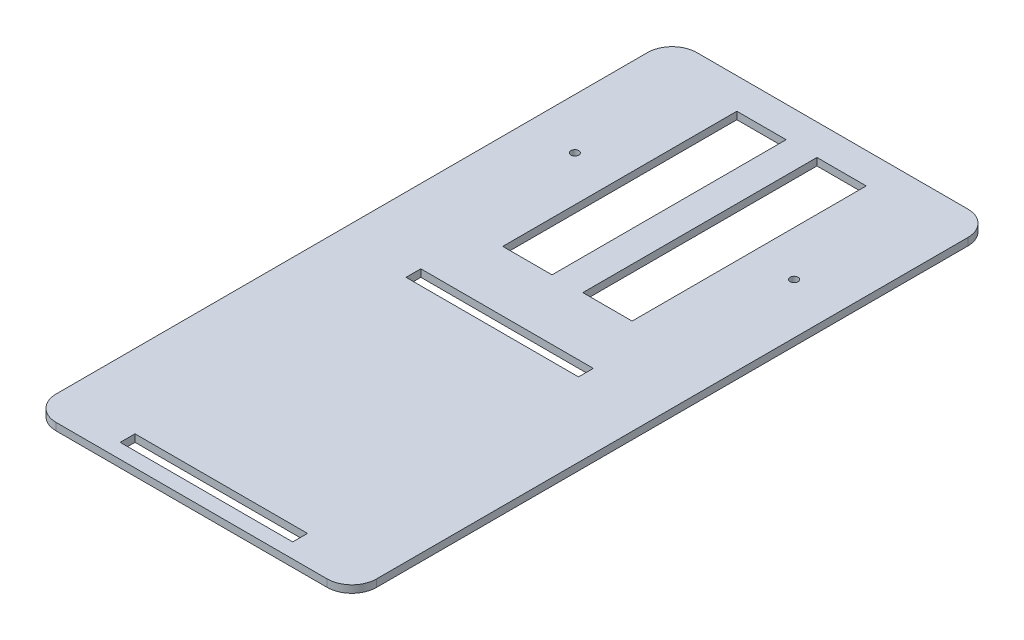
ISO-10303-21;
HEADER;
FILE_DESCRIPTION(('STEP AP214'),'2;1');
FILE_NAME('part.step','',(''),(''),'','','');
FILE_SCHEMA(('AUTOMOTIVE_DESIGN { 1 0 10303 214 1 1 1 1 }'));
ENDSEC;
DATA;
#1=APPLICATION_CONTEXT('core data for automotive mechanical design processes');
#2=APPLICATION_PROTOCOL_DEFINITION('international standard','automotive_design',2000,#1);
#3=PRODUCT_CONTEXT('',#1,'mechanical');
#4=PRODUCT('Part','Part','',(#3));
#5=PRODUCT_RELATED_PRODUCT_CATEGORY('part','',(#4));
#6=PRODUCT_DEFINITION_FORMATION('','',#4);
#7=PRODUCT_DEFINITION_CONTEXT('part definition',#1,'design');
#8=PRODUCT_DEFINITION('design','',#6,#7);
#9=PRODUCT_DEFINITION_SHAPE('','',#8);
#10=(LENGTH_UNIT() NAMED_UNIT(*) SI_UNIT(.MILLI.,.METRE.));
#11=(NAMED_UNIT(*) PLANE_ANGLE_UNIT() SI_UNIT($,.RADIAN.));
#12=(NAMED_UNIT(*) SI_UNIT($,.STERADIAN.) SOLID_ANGLE_UNIT());
#13=UNCERTAINTY_MEASURE_WITH_UNIT(LENGTH_MEASURE(1.E-05),#10,'distance_accuracy_value','');
#14=(GEOMETRIC_REPRESENTATION_CONTEXT(3) GLOBAL_UNCERTAINTY_ASSIGNED_CONTEXT((#13)) GLOBAL_UNIT_ASSIGNED_CONTEXT((#10,
#11,#12)) REPRESENTATION_CONTEXT('',''));
#15=CARTESIAN_POINT('',(0.,0.,0.));
#16=DIRECTION('',(0.,0.,1.));
#17=DIRECTION('',(1.,0.,0.));
#18=AXIS2_PLACEMENT_3D('',#15,#16,#17);
#19=CARTESIAN_POINT('',(0.,3.,0.));
#20=DIRECTION('',(0.,-1.,0.));
#21=DIRECTION('',(0.,0.,-1.));
#22=AXIS2_PLACEMENT_3D('',#19,#20,#21);
#23=PLANE('',#22);
#24=DIRECTION('',(1.,0.,0.));
#25=VECTOR('',#24,1.);
#26=CARTESIAN_POINT('',(0.,3.,72.));
#27=LINE('',#26,#25);
#28=CARTESIAN_POINT('',(-35.,3.,72.));
#29=VERTEX_POINT('',#28);
#30=CARTESIAN_POINT('',(35.,3.,72.));
#31=VERTEX_POINT('',#30);
#32=EDGE_CURVE('E266',#29,#31,#27,.T.);
#33=ORIENTED_EDGE('',*,*,#32,.T.);
#34=DIRECTION('',(0.,0.,1.));
#35=VECTOR('',#34,1.);
#36=CARTESIAN_POINT('',(35.,3.,0.));
#37=LINE('',#36,#35);
#38=CARTESIAN_POINT('',(35.,3.,78.));
#39=VERTEX_POINT('',#38);
#40=EDGE_CURVE('E203',#31,#39,#37,.T.);
#41=ORIENTED_EDGE('',*,*,#40,.T.);
#42=DIRECTION('',(-1.,0.,0.));
#43=VECTOR('',#42,1.);
#44=CARTESIAN_POINT('',(0.,3.,78.));
#45=LINE('',#44,#43);
#46=CARTESIAN_POINT('',(-35.,3.,78.));
#47=VERTEX_POINT('',#46);
#48=EDGE_CURVE('E271',#39,#47,#45,.T.);
#49=ORIENTED_EDGE('',*,*,#48,.T.);
#50=DIRECTION('',(0.,0.,-1.));
#51=VECTOR('',#50,1.);
#52=CARTESIAN_POINT('',(-35.,3.,0.));
#53=LINE('',#52,#51);
#54=EDGE_CURVE('E268',#47,#29,#53,.T.);
#55=ORIENTED_EDGE('',*,*,#54,.T.);
#56=EDGE_LOOP('',(#33,#41,#49,#55));
#57=FACE_BOUND('',#56,.T.);
#58=DIRECTION('',(1.,0.,0.));
#59=VECTOR('',#58,1.);
#60=CARTESIAN_POINT('',(0.,3.,188.));
#61=LINE('',#60,#59);
#62=CARTESIAN_POINT('',(-35.,3.,188.));
#63=VERTEX_POINT('',#62);
#64=CARTESIAN_POINT('',(35.,3.,188.));
#65=VERTEX_POINT('',#64);
#66=EDGE_CURVE('E231',#63,#65,#61,.T.);
#67=ORIENTED_EDGE('',*,*,#66,.T.);
#68=DIRECTION('',(0.,0.,1.));
#69=VECTOR('',#68,1.);
#70=CARTESIAN_POINT('',(35.,3.,0.));
#71=LINE('',#70,#69);
#72=CARTESIAN_POINT('',(35.,3.,194.));
#73=VERTEX_POINT('',#72);
#74=EDGE_CURVE('E263',#65,#73,#71,.T.);
#75=ORIENTED_EDGE('',*,*,#74,.T.);
#76=DIRECTION('',(-1.,0.,0.));
#77=VECTOR('',#76,1.);
#78=CARTESIAN_POINT('',(0.,3.,194.));
#79=LINE('',#78,#77);
#80=CARTESIAN_POINT('',(-35.,3.,194.));
#81=VERTEX_POINT('',#80);
#82=EDGE_CURVE('E260',#73,#81,#79,.T.);
#83=ORIENTED_EDGE('',*,*,#82,.T.);
#84=DIRECTION('',(0.,0.,-1.));
#85=VECTOR('',#84,1.);
#86=CARTESIAN_POINT('',(-35.,3.,0.));
#87=LINE('',#86,#85);
#88=EDGE_CURVE('E257',#81,#63,#87,.T.);
#89=ORIENTED_EDGE('',*,*,#88,.T.);
#90=EDGE_LOOP('',(#67,#75,#83,#89));
#91=FACE_BOUND('',#90,.T.);
#92=CARTESIAN_POINT('',(-44.5,3.,0.));
#93=DIRECTION('',(0.,-1.,0.));
#94=DIRECTION('',(0.,0.,-1.));
#95=AXIS2_PLACEMENT_3D('',#92,#93,#94);
#96=CIRCLE('',#95,1.6);
#97=CARTESIAN_POINT('',(-44.5,3.,-1.6));
#98=VERTEX_POINT('',#97);
#99=EDGE_CURVE('E284',#98,#98,#96,.F.);
#100=ORIENTED_EDGE('',*,*,#99,.F.);
#101=EDGE_LOOP('',(#100));
#102=FACE_BOUND('',#101,.T.);
#103=CARTESIAN_POINT('',(44.5,3.,0.));
#104=DIRECTION('',(0.,-1.,0.));
#105=DIRECTION('',(0.,0.,-1.));
#106=AXIS2_PLACEMENT_3D('',#103,#104,#105);
#107=CIRCLE('',#106,1.6);
#108=CARTESIAN_POINT('',(44.5,3.,-1.6));
#109=VERTEX_POINT('',#108);
#110=EDGE_CURVE('E290',#109,#109,#107,.T.);
#111=ORIENTED_EDGE('',*,*,#110,.T.);
#112=EDGE_LOOP('',(#111));
#113=FACE_BOUND('',#112,.T.);
#114=DIRECTION('',(-1.,0.,0.));
#115=VECTOR('',#114,1.);
#116=CARTESIAN_POINT('',(65.,3.,200.));
#117=LINE('',#116,#115);
#118=CARTESIAN_POINT('',(55.,3.,200.));
#119=VERTEX_POINT('',#118);
#120=CARTESIAN_POINT('',(-55.,3.,200.));
#121=VERTEX_POINT('',#120);
#122=EDGE_CURVE('E278',#119,#121,#117,.T.);
#123=ORIENTED_EDGE('',*,*,#122,.F.);
#124=CARTESIAN_POINT('',(55.,3.,190.));
#125=DIRECTION('',(0.,-1.,0.));
#126=DIRECTION('',(0.,0.,-1.));
#127=AXIS2_PLACEMENT_3D('',#124,#125,#126);
#128=CIRCLE('',#127,10.);
#129=CARTESIAN_POINT('',(65.,3.,190.));
#130=VERTEX_POINT('',#129);
#131=EDGE_CURVE('E386',#119,#130,#128,.F.);
#132=ORIENTED_EDGE('',*,*,#131,.T.);
#133=DIRECTION('',(0.,0.,-1.));
#134=VECTOR('',#133,1.);
#135=CARTESIAN_POINT('',(65.,3.,60.));
#136=LINE('',#135,#134);
#137=CARTESIAN_POINT('',(65.,3.,-50.));
#138=VERTEX_POINT('',#137);
#139=EDGE_CURVE('E358',#130,#138,#136,.T.);
#140=ORIENTED_EDGE('',*,*,#139,.T.);
#141=CARTESIAN_POINT('',(55.,3.,-50.));
#142=DIRECTION('',(0.,-1.,0.));
#143=DIRECTION('',(0.,0.,-1.));
#144=AXIS2_PLACEMENT_3D('',#141,#142,#143);
#145=CIRCLE('',#144,10.);
#146=CARTESIAN_POINT('',(55.,3.,-60.));
#147=VERTEX_POINT('',#146);
#148=EDGE_CURVE('E382',#138,#147,#145,.F.);
#149=ORIENTED_EDGE('',*,*,#148,.T.);
#150=DIRECTION('',(-1.,0.,0.));
#151=VECTOR('',#150,1.);
#152=CARTESIAN_POINT('',(-65.,3.,-60.));
#153=LINE('',#152,#151);
#154=CARTESIAN_POINT('',(-55.,3.,-60.));
#155=VERTEX_POINT('',#154);
#156=EDGE_CURVE('E361',#147,#155,#153,.T.);
#157=ORIENTED_EDGE('',*,*,#156,.T.);
#158=CARTESIAN_POINT('',(-55.,3.,-50.));
#159=DIRECTION('',(0.,-1.,0.));
#160=DIRECTION('',(0.,0.,-1.));
#161=AXIS2_PLACEMENT_3D('',#158,#159,#160);
#162=CIRCLE('',#161,10.);
#163=CARTESIAN_POINT('',(-65.,3.,-50.));
#164=VERTEX_POINT('',#163);
#165=EDGE_CURVE('E380',#155,#164,#162,.F.);
#166=ORIENTED_EDGE('',*,*,#165,.T.);
#167=DIRECTION('',(0.,0.,1.));
#168=VECTOR('',#167,1.);
#169=CARTESIAN_POINT('',(-65.,3.,60.));
#170=LINE('',#169,#168);
#171=CARTESIAN_POINT('',(-65.,3.,190.));
#172=VERTEX_POINT('',#171);
#173=EDGE_CURVE('E365',#164,#172,#170,.T.);
#174=ORIENTED_EDGE('',*,*,#173,.T.);
#175=CARTESIAN_POINT('',(-55.,3.,190.));
#176=DIRECTION('',(0.,-1.,0.));
#177=DIRECTION('',(0.,0.,-1.));
#178=AXIS2_PLACEMENT_3D('',#175,#176,#177);
#179=CIRCLE('',#178,10.);
#180=EDGE_CURVE('E384',#172,#121,#179,.F.);
#181=ORIENTED_EDGE('',*,*,#180,.T.);
#182=EDGE_LOOP('',(#123,#132,#140,#149,#157,#166,#174,#181));
#183=FACE_BOUND('',#182,.T.);
#184=DIRECTION('',(1.,0.,0.));
#185=VECTOR('',#184,1.);
#186=CARTESIAN_POINT('',(0.,3.,-47.5));
#187=LINE('',#186,#185);
#188=CARTESIAN_POINT('',(-26.25,3.,-47.5));
#189=VERTEX_POINT('',#188);
#190=CARTESIAN_POINT('',(-6.25,3.,-47.5));
#191=VERTEX_POINT('',#190);
#192=EDGE_CURVE('E338',#189,#191,#187,.T.);
#193=ORIENTED_EDGE('',*,*,#192,.T.);
#194=DIRECTION('',(0.,0.,1.));
#195=VECTOR('',#194,1.);
#196=CARTESIAN_POINT('',(-6.25,3.,0.));
#197=LINE('',#196,#195);
#198=CARTESIAN_POINT('',(-6.25,3.,47.5));
#199=VERTEX_POINT('',#198);
#200=EDGE_CURVE('E354',#191,#199,#197,.T.);
#201=ORIENTED_EDGE('',*,*,#200,.T.);
#202=DIRECTION('',(-1.,0.,0.));
#203=VECTOR('',#202,1.);
#204=CARTESIAN_POINT('',(0.,3.,47.5));
#205=LINE('',#204,#203);
#206=CARTESIAN_POINT('',(-26.25,3.,47.5));
#207=VERTEX_POINT('',#206);
#208=EDGE_CURVE('E351',#199,#207,#205,.T.);
#209=ORIENTED_EDGE('',*,*,#208,.T.);
#210=DIRECTION('',(0.,0.,-1.));
#211=VECTOR('',#210,1.);
#212=CARTESIAN_POINT('',(-26.25,3.,0.));
#213=LINE('',#212,#211);
#214=EDGE_CURVE('E348',#207,#189,#213,.T.);
#215=ORIENTED_EDGE('',*,*,#214,.T.);
#216=EDGE_LOOP('',(#193,#201,#209,#215));
#217=FACE_BOUND('',#216,.T.);
#218=DIRECTION('',(0.,0.,1.));
#219=VECTOR('',#218,1.);
#220=CARTESIAN_POINT('',(6.25,3.,0.));
#221=LINE('',#220,#219);
#222=CARTESIAN_POINT('',(6.25,3.,-47.5));
#223=VERTEX_POINT('',#222);
#224=CARTESIAN_POINT('',(6.25,3.,47.5));
#225=VERTEX_POINT('',#224);
#226=EDGE_CURVE('E319',#223,#225,#221,.T.);
#227=ORIENTED_EDGE('',*,*,#226,.F.);
#228=DIRECTION('',(-1.,0.,0.));
#229=VECTOR('',#228,1.);
#230=CARTESIAN_POINT('',(0.,3.,-47.5));
#231=LINE('',#230,#229);
#232=CARTESIAN_POINT('',(26.25,3.,-47.5));
#233=VERTEX_POINT('',#232);
#234=EDGE_CURVE('E317',#233,#223,#231,.T.);
#235=ORIENTED_EDGE('',*,*,#234,.F.);
#236=DIRECTION('',(0.,0.,-1.));
#237=VECTOR('',#236,1.);
#238=CARTESIAN_POINT('',(26.25,3.,0.));
#239=LINE('',#238,#237);
#240=CARTESIAN_POINT('',(26.25,3.,47.5));
#241=VERTEX_POINT('',#240);
#242=EDGE_CURVE('E315',#241,#233,#239,.T.);
#243=ORIENTED_EDGE('',*,*,#242,.F.);
#244=DIRECTION('',(1.,0.,0.));
#245=VECTOR('',#244,1.);
#246=CARTESIAN_POINT('',(0.,3.,47.5));
#247=LINE('',#246,#245);
#248=EDGE_CURVE('E306',#225,#241,#247,.T.);
#249=ORIENTED_EDGE('',*,*,#248,.F.);
#250=EDGE_LOOP('',(#227,#235,#243,#249));
#251=FACE_BOUND('',#250,.T.);
#252=ADVANCED_FACE('F33',(#57,#91,#102,#113,#183,#217,#251),#23,.F.);
#253=CARTESIAN_POINT('',(0.,0.,0.));
#254=DIRECTION('',(0.,-1.,0.));
#255=DIRECTION('',(0.,0.,-1.));
#256=AXIS2_PLACEMENT_3D('',#253,#254,#255);
#257=PLANE('',#256);
#258=DIRECTION('',(0.,0.,-1.));
#259=VECTOR('',#258,1.);
#260=CARTESIAN_POINT('',(35.,0.,78.));
#261=LINE('',#260,#259);
#262=CARTESIAN_POINT('',(35.,0.,78.));
#263=VERTEX_POINT('',#262);
#264=CARTESIAN_POINT('',(35.,0.,72.));
#265=VERTEX_POINT('',#264);
#266=EDGE_CURVE('E200',#263,#265,#261,.T.);
#267=ORIENTED_EDGE('',*,*,#266,.T.);
#268=DIRECTION('',(-1.,0.,0.));
#269=VECTOR('',#268,1.);
#270=CARTESIAN_POINT('',(-35.,0.,72.));
#271=LINE('',#270,#269);
#272=CARTESIAN_POINT('',(-35.,0.,72.));
#273=VERTEX_POINT('',#272);
#274=EDGE_CURVE('E211',#265,#273,#271,.T.);
#275=ORIENTED_EDGE('',*,*,#274,.T.);
#276=DIRECTION('',(0.,0.,1.));
#277=VECTOR('',#276,1.);
#278=CARTESIAN_POINT('',(-35.,0.,78.));
#279=LINE('',#278,#277);
#280=CARTESIAN_POINT('',(-35.,0.,78.));
#281=VERTEX_POINT('',#280);
#282=EDGE_CURVE('E216',#273,#281,#279,.T.);
#283=ORIENTED_EDGE('',*,*,#282,.T.);
#284=DIRECTION('',(1.,0.,0.));
#285=VECTOR('',#284,1.);
#286=CARTESIAN_POINT('',(-35.,0.,78.));
#287=LINE('',#286,#285);
#288=EDGE_CURVE('E207',#281,#263,#287,.T.);
#289=ORIENTED_EDGE('',*,*,#288,.T.);
#290=EDGE_LOOP('',(#267,#275,#283,#289));
#291=FACE_BOUND('',#290,.T.);
#292=DIRECTION('',(0.,0.,-1.));
#293=VECTOR('',#292,1.);
#294=CARTESIAN_POINT('',(35.,0.,194.));
#295=LINE('',#294,#293);
#296=CARTESIAN_POINT('',(35.,0.,194.));
#297=VERTEX_POINT('',#296);
#298=CARTESIAN_POINT('',(35.,0.,188.));
#299=VERTEX_POINT('',#298);
#300=EDGE_CURVE('E236',#297,#299,#295,.T.);
#301=ORIENTED_EDGE('',*,*,#300,.T.);
#302=DIRECTION('',(-1.,0.,0.));
#303=VECTOR('',#302,1.);
#304=CARTESIAN_POINT('',(-35.,0.,188.));
#305=LINE('',#304,#303);
#306=CARTESIAN_POINT('',(-35.,0.,188.));
#307=VERTEX_POINT('',#306);
#308=EDGE_CURVE('E239',#299,#307,#305,.T.);
#309=ORIENTED_EDGE('',*,*,#308,.T.);
#310=DIRECTION('',(0.,0.,1.));
#311=VECTOR('',#310,1.);
#312=CARTESIAN_POINT('',(-35.,0.,194.));
#313=LINE('',#312,#311);
#314=CARTESIAN_POINT('',(-35.,0.,194.));
#315=VERTEX_POINT('',#314);
#316=EDGE_CURVE('E242',#307,#315,#313,.T.);
#317=ORIENTED_EDGE('',*,*,#316,.T.);
#318=DIRECTION('',(1.,0.,0.));
#319=VECTOR('',#318,1.);
#320=CARTESIAN_POINT('',(-35.,0.,194.));
#321=LINE('',#320,#319);
#322=EDGE_CURVE('E245',#315,#297,#321,.T.);
#323=ORIENTED_EDGE('',*,*,#322,.T.);
#324=EDGE_LOOP('',(#301,#309,#317,#323));
#325=FACE_BOUND('',#324,.T.);
#326=CARTESIAN_POINT('',(-44.5,0.,0.));
#327=DIRECTION('',(0.,-1.,0.));
#328=DIRECTION('',(0.,0.,1.));
#329=AXIS2_PLACEMENT_3D('',#326,#327,#328);
#330=CIRCLE('',#329,1.6);
#331=CARTESIAN_POINT('',(-44.5,0.,1.6));
#332=VERTEX_POINT('',#331);
#333=EDGE_CURVE('E281',#332,#332,#330,.T.);
#334=ORIENTED_EDGE('',*,*,#333,.F.);
#335=EDGE_LOOP('',(#334));
#336=FACE_BOUND('',#335,.T.);
#337=CARTESIAN_POINT('',(44.5,0.,0.));
#338=DIRECTION('',(0.,1.,0.));
#339=DIRECTION('',(0.,0.,1.));
#340=AXIS2_PLACEMENT_3D('',#337,#338,#339);
#341=CIRCLE('',#340,1.6);
#342=CARTESIAN_POINT('',(44.5,0.,1.6));
#343=VERTEX_POINT('',#342);
#344=EDGE_CURVE('E287',#343,#343,#341,.T.);
#345=ORIENTED_EDGE('',*,*,#344,.T.);
#346=EDGE_LOOP('',(#345));
#347=FACE_BOUND('',#346,.T.);
#348=DIRECTION('',(0.,0.,-1.));
#349=VECTOR('',#348,1.);
#350=CARTESIAN_POINT('',(-6.25,0.,47.5));
#351=LINE('',#350,#349);
#352=CARTESIAN_POINT('',(-6.25,0.,47.5));
#353=VERTEX_POINT('',#352);
#354=CARTESIAN_POINT('',(-6.25,0.,-47.5));
#355=VERTEX_POINT('',#354);
#356=EDGE_CURVE('E322',#353,#355,#351,.T.);
#357=ORIENTED_EDGE('',*,*,#356,.T.);
#358=DIRECTION('',(-1.,0.,0.));
#359=VECTOR('',#358,1.);
#360=CARTESIAN_POINT('',(-26.25,0.,-47.5));
#361=LINE('',#360,#359);
#362=CARTESIAN_POINT('',(-26.25,0.,-47.5));
#363=VERTEX_POINT('',#362);
#364=EDGE_CURVE('E325',#355,#363,#361,.T.);
#365=ORIENTED_EDGE('',*,*,#364,.T.);
#366=DIRECTION('',(0.,0.,1.));
#367=VECTOR('',#366,1.);
#368=CARTESIAN_POINT('',(-26.25,0.,47.5));
#369=LINE('',#368,#367);
#370=CARTESIAN_POINT('',(-26.25,0.,47.5));
#371=VERTEX_POINT('',#370);
#372=EDGE_CURVE('E328',#363,#371,#369,.T.);
#373=ORIENTED_EDGE('',*,*,#372,.T.);
#374=DIRECTION('',(1.,0.,0.));
#375=VECTOR('',#374,1.);
#376=CARTESIAN_POINT('',(-26.25,0.,47.5));
#377=LINE('',#376,#375);
#378=EDGE_CURVE('E331',#371,#353,#377,.T.);
#379=ORIENTED_EDGE('',*,*,#378,.T.);
#380=EDGE_LOOP('',(#357,#365,#373,#379));
#381=FACE_BOUND('',#380,.T.);
#382=DIRECTION('',(0.,0.,-1.));
#383=VECTOR('',#382,1.);
#384=CARTESIAN_POINT('',(65.,0.,60.));
#385=LINE('',#384,#383);
#386=CARTESIAN_POINT('',(65.,0.,190.));
#387=VERTEX_POINT('',#386);
#388=CARTESIAN_POINT('',(65.,0.,-50.));
#389=VERTEX_POINT('',#388);
#390=EDGE_CURVE('E357',#387,#389,#385,.T.);
#391=ORIENTED_EDGE('',*,*,#390,.F.);
#392=CARTESIAN_POINT('',(55.,0.,190.));
#393=DIRECTION('',(0.,-1.,0.));
#394=DIRECTION('',(0.,0.,-1.));
#395=AXIS2_PLACEMENT_3D('',#392,#393,#394);
#396=CIRCLE('',#395,10.);
#397=CARTESIAN_POINT('',(55.,0.,200.));
#398=VERTEX_POINT('',#397);
#399=EDGE_CURVE('E396',#387,#398,#396,.T.);
#400=ORIENTED_EDGE('',*,*,#399,.T.);
#401=DIRECTION('',(1.,0.,0.));
#402=VECTOR('',#401,1.);
#403=CARTESIAN_POINT('',(-65.,0.,200.));
#404=LINE('',#403,#402);
#405=CARTESIAN_POINT('',(-55.,0.,200.));
#406=VERTEX_POINT('',#405);
#407=EDGE_CURVE('E275',#406,#398,#404,.T.);
#408=ORIENTED_EDGE('',*,*,#407,.F.);
#409=CARTESIAN_POINT('',(-55.,0.,190.));
#410=DIRECTION('',(0.,-1.,0.));
#411=DIRECTION('',(0.,0.,-1.));
#412=AXIS2_PLACEMENT_3D('',#409,#410,#411);
#413=CIRCLE('',#412,10.);
#414=CARTESIAN_POINT('',(-65.,0.,190.));
#415=VERTEX_POINT('',#414);
#416=EDGE_CURVE('E394',#406,#415,#413,.T.);
#417=ORIENTED_EDGE('',*,*,#416,.T.);
#418=DIRECTION('',(0.,0.,1.));
#419=VECTOR('',#418,1.);
#420=CARTESIAN_POINT('',(-65.,0.,60.));
#421=LINE('',#420,#419);
#422=CARTESIAN_POINT('',(-65.,0.,-50.));
#423=VERTEX_POINT('',#422);
#424=EDGE_CURVE('E362',#423,#415,#421,.T.);
#425=ORIENTED_EDGE('',*,*,#424,.F.);
#426=CARTESIAN_POINT('',(-55.,0.,-50.));
#427=DIRECTION('',(0.,-1.,0.));
#428=DIRECTION('',(0.,0.,-1.));
#429=AXIS2_PLACEMENT_3D('',#426,#427,#428);
#430=CIRCLE('',#429,10.);
#431=CARTESIAN_POINT('',(-55.,0.,-60.));
#432=VERTEX_POINT('',#431);
#433=EDGE_CURVE('E48',#423,#432,#430,.T.);
#434=ORIENTED_EDGE('',*,*,#433,.T.);
#435=DIRECTION('',(-1.,0.,0.));
#436=VECTOR('',#435,1.);
#437=CARTESIAN_POINT('',(-65.,0.,-60.));
#438=LINE('',#437,#436);
#439=CARTESIAN_POINT('',(55.,0.,-60.));
#440=VERTEX_POINT('',#439);
#441=EDGE_CURVE('E371',#440,#432,#438,.T.);
#442=ORIENTED_EDGE('',*,*,#441,.F.);
#443=CARTESIAN_POINT('',(55.,0.,-50.));
#444=DIRECTION('',(0.,-1.,0.));
#445=DIRECTION('',(0.,0.,-1.));
#446=AXIS2_PLACEMENT_3D('',#443,#444,#445);
#447=CIRCLE('',#446,10.);
#448=EDGE_CURVE('E56',#440,#389,#447,.T.);
#449=ORIENTED_EDGE('',*,*,#448,.T.);
#450=EDGE_LOOP('',(#391,#400,#408,#417,#425,#434,#442,#449));
#451=FACE_BOUND('',#450,.T.);
#452=DIRECTION('',(1.,0.,0.));
#453=VECTOR('',#452,1.);
#454=CARTESIAN_POINT('',(26.25,0.,-47.5));
#455=LINE('',#454,#453);
#456=CARTESIAN_POINT('',(6.25,0.,-47.5));
#457=VERTEX_POINT('',#456);
#458=CARTESIAN_POINT('',(26.25,0.,-47.5));
#459=VERTEX_POINT('',#458);
#460=EDGE_CURVE('E300',#457,#459,#455,.T.);
#461=ORIENTED_EDGE('',*,*,#460,.F.);
#462=DIRECTION('',(0.,0.,-1.));
#463=VECTOR('',#462,1.);
#464=CARTESIAN_POINT('',(6.25,0.,47.5));
#465=LINE('',#464,#463);
#466=CARTESIAN_POINT('',(6.25,0.,47.5));
#467=VERTEX_POINT('',#466);
#468=EDGE_CURVE('E293',#467,#457,#465,.T.);
#469=ORIENTED_EDGE('',*,*,#468,.F.);
#470=DIRECTION('',(-1.,0.,0.));
#471=VECTOR('',#470,1.);
#472=CARTESIAN_POINT('',(26.25,0.,47.5));
#473=LINE('',#472,#471);
#474=CARTESIAN_POINT('',(26.25,0.,47.5));
#475=VERTEX_POINT('',#474);
#476=EDGE_CURVE('E295',#475,#467,#473,.T.);
#477=ORIENTED_EDGE('',*,*,#476,.F.);
#478=DIRECTION('',(0.,0.,1.));
#479=VECTOR('',#478,1.);
#480=CARTESIAN_POINT('',(26.25,0.,47.5));
#481=LINE('',#480,#479);
#482=EDGE_CURVE('E297',#459,#475,#481,.T.);
#483=ORIENTED_EDGE('',*,*,#482,.F.);
#484=EDGE_LOOP('',(#461,#469,#477,#483));
#485=FACE_BOUND('',#484,.T.);
#486=ADVANCED_FACE('F218',(#291,#325,#336,#347,#381,#451,#485),#257,.T.);
#487=CARTESIAN_POINT('',(65.,3.,60.));
#488=DIRECTION('',(-1.,0.,0.));
#489=DIRECTION('',(0.,0.,1.));
#490=AXIS2_PLACEMENT_3D('',#487,#488,#489);
#491=PLANE('',#490);
#492=ORIENTED_EDGE('',*,*,#139,.F.);
#493=DIRECTION('',(0.,1.,0.));
#494=VECTOR('',#493,1.);
#495=CARTESIAN_POINT('',(65.,0.,190.));
#496=LINE('',#495,#494);
#497=EDGE_CURVE('E390',#130,#387,#496,.F.);
#498=ORIENTED_EDGE('',*,*,#497,.T.);
#499=ORIENTED_EDGE('',*,*,#390,.T.);
#500=DIRECTION('',(0.,-1.,0.));
#501=VECTOR('',#500,1.);
#502=CARTESIAN_POINT('',(65.,3.,-50.));
#503=LINE('',#502,#501);
#504=EDGE_CURVE('E388',#389,#138,#503,.F.);
#505=ORIENTED_EDGE('',*,*,#504,.T.);
#506=EDGE_LOOP('',(#492,#498,#499,#505));
#507=FACE_BOUND('',#506,.T.);
#508=ADVANCED_FACE('F431',(#507),#491,.F.);
#509=CARTESIAN_POINT('',(-65.,3.,-60.));
#510=DIRECTION('',(0.,0.,1.));
#511=DIRECTION('',(1.,0.,0.));
#512=AXIS2_PLACEMENT_3D('',#509,#510,#511);
#513=PLANE('',#512);
#514=ORIENTED_EDGE('',*,*,#156,.F.);
#515=DIRECTION('',(0.,-1.,0.));
#516=VECTOR('',#515,1.);
#517=CARTESIAN_POINT('',(55.,3.,-60.));
#518=LINE('',#517,#516);
#519=EDGE_CURVE('E11',#147,#440,#518,.T.);
#520=ORIENTED_EDGE('',*,*,#519,.T.);
#521=ORIENTED_EDGE('',*,*,#441,.T.);
#522=DIRECTION('',(0.,-1.,0.));
#523=VECTOR('',#522,1.);
#524=CARTESIAN_POINT('',(-55.,3.,-60.));
#525=LINE('',#524,#523);
#526=EDGE_CURVE('E41',#432,#155,#525,.F.);
#527=ORIENTED_EDGE('',*,*,#526,.T.);
#528=EDGE_LOOP('',(#514,#520,#521,#527));
#529=FACE_BOUND('',#528,.T.);
#530=ADVANCED_FACE('F405',(#529),#513,.F.);
#531=CARTESIAN_POINT('',(-65.,3.,60.));
#532=DIRECTION('',(1.,0.,0.));
#533=DIRECTION('',(0.,0.,-1.));
#534=AXIS2_PLACEMENT_3D('',#531,#532,#533);
#535=PLANE('',#534);
#536=ORIENTED_EDGE('',*,*,#424,.T.);
#537=DIRECTION('',(0.,-1.,0.));
#538=VECTOR('',#537,1.);
#539=CARTESIAN_POINT('',(-65.,3.,190.));
#540=LINE('',#539,#538);
#541=EDGE_CURVE('E401',#415,#172,#540,.F.);
#542=ORIENTED_EDGE('',*,*,#541,.T.);
#543=ORIENTED_EDGE('',*,*,#173,.F.);
#544=DIRECTION('',(0.,-1.,0.));
#545=VECTOR('',#544,1.);
#546=CARTESIAN_POINT('',(-65.,3.,-50.));
#547=LINE('',#546,#545);
#548=EDGE_CURVE('E398',#164,#423,#547,.T.);
#549=ORIENTED_EDGE('',*,*,#548,.T.);
#550=EDGE_LOOP('',(#536,#542,#543,#549));
#551=FACE_BOUND('',#550,.T.);
#552=ADVANCED_FACE('F415',(#551),#535,.F.);
#553=CARTESIAN_POINT('',(-6.25,0.,47.5));
#554=DIRECTION('',(1.,0.,0.));
#555=DIRECTION('',(0.,0.,-1.));
#556=AXIS2_PLACEMENT_3D('',#553,#554,#555);
#557=PLANE('',#556);
#558=DIRECTION('',(0.,1.,0.));
#559=VECTOR('',#558,1.);
#560=CARTESIAN_POINT('',(-6.25,0.,-47.5));
#561=LINE('',#560,#559);
#562=EDGE_CURVE('E334',#355,#191,#561,.T.);
#563=ORIENTED_EDGE('',*,*,#562,.F.);
#564=ORIENTED_EDGE('',*,*,#356,.F.);
#565=DIRECTION('',(0.,1.,0.));
#566=VECTOR('',#565,1.);
#567=CARTESIAN_POINT('',(-6.25,0.,47.5));
#568=LINE('',#567,#566);
#569=EDGE_CURVE('E335',#353,#199,#568,.T.);
#570=ORIENTED_EDGE('',*,*,#569,.T.);
#571=ORIENTED_EDGE('',*,*,#200,.F.);
#572=EDGE_LOOP('',(#563,#564,#570,#571));
#573=FACE_BOUND('',#572,.T.);
#574=ADVANCED_FACE('F451',(#573),#557,.F.);
#575=CARTESIAN_POINT('',(-26.25,0.,47.5));
#576=DIRECTION('',(0.,0.,1.));
#577=DIRECTION('',(1.,0.,0.));
#578=AXIS2_PLACEMENT_3D('',#575,#576,#577);
#579=PLANE('',#578);
#580=ORIENTED_EDGE('',*,*,#569,.F.);
#581=ORIENTED_EDGE('',*,*,#378,.F.);
#582=DIRECTION('',(0.,1.,0.));
#583=VECTOR('',#582,1.);
#584=CARTESIAN_POINT('',(-26.25,0.,47.5));
#585=LINE('',#584,#583);
#586=EDGE_CURVE('E339',#371,#207,#585,.T.);
#587=ORIENTED_EDGE('',*,*,#586,.T.);
#588=ORIENTED_EDGE('',*,*,#208,.F.);
#589=EDGE_LOOP('',(#580,#581,#587,#588));
#590=FACE_BOUND('',#589,.T.);
#591=ADVANCED_FACE('F518',(#590),#579,.F.);
#592=CARTESIAN_POINT('',(-26.25,0.,47.5));
#593=DIRECTION('',(-1.,0.,0.));
#594=DIRECTION('',(0.,0.,1.));
#595=AXIS2_PLACEMENT_3D('',#592,#593,#594);
#596=PLANE('',#595);
#597=ORIENTED_EDGE('',*,*,#586,.F.);
#598=ORIENTED_EDGE('',*,*,#372,.F.);
#599=DIRECTION('',(0.,1.,0.));
#600=VECTOR('',#599,1.);
#601=CARTESIAN_POINT('',(-26.25,0.,-47.5));
#602=LINE('',#601,#600);
#603=EDGE_CURVE('E342',#363,#189,#602,.T.);
#604=ORIENTED_EDGE('',*,*,#603,.T.);
#605=ORIENTED_EDGE('',*,*,#214,.F.);
#606=EDGE_LOOP('',(#597,#598,#604,#605));
#607=FACE_BOUND('',#606,.T.);
#608=ADVANCED_FACE('F521',(#607),#596,.F.);
#609=CARTESIAN_POINT('',(-26.25,0.,-47.5));
#610=DIRECTION('',(0.,0.,-1.));
#611=DIRECTION('',(-1.,0.,0.));
#612=AXIS2_PLACEMENT_3D('',#609,#610,#611);
#613=PLANE('',#612);
#614=ORIENTED_EDGE('',*,*,#603,.F.);
#615=ORIENTED_EDGE('',*,*,#364,.F.);
#616=ORIENTED_EDGE('',*,*,#562,.T.);
#617=ORIENTED_EDGE('',*,*,#192,.F.);
#618=EDGE_LOOP('',(#614,#615,#616,#617));
#619=FACE_BOUND('',#618,.T.);
#620=ADVANCED_FACE('F516',(#619),#613,.F.);
#621=CARTESIAN_POINT('',(6.25,0.,47.5));
#622=DIRECTION('',(1.,0.,0.));
#623=DIRECTION('',(0.,0.,-1.));
#624=AXIS2_PLACEMENT_3D('',#621,#622,#623);
#625=PLANE('',#624);
#626=ORIENTED_EDGE('',*,*,#226,.T.);
#627=DIRECTION('',(0.,1.,0.));
#628=VECTOR('',#627,1.);
#629=CARTESIAN_POINT('',(6.25,0.,47.5));
#630=LINE('',#629,#628);
#631=EDGE_CURVE('E302',#467,#225,#630,.T.);
#632=ORIENTED_EDGE('',*,*,#631,.F.);
#633=ORIENTED_EDGE('',*,*,#468,.T.);
#634=DIRECTION('',(0.,1.,0.));
#635=VECTOR('',#634,1.);
#636=CARTESIAN_POINT('',(6.25,0.,-47.5));
#637=LINE('',#636,#635);
#638=EDGE_CURVE('E303',#457,#223,#637,.T.);
#639=ORIENTED_EDGE('',*,*,#638,.T.);
#640=EDGE_LOOP('',(#626,#632,#633,#639));
#641=FACE_BOUND('',#640,.T.);
#642=ADVANCED_FACE('F506',(#641),#625,.T.);
#643=CARTESIAN_POINT('',(26.25,0.,-47.5));
#644=DIRECTION('',(0.,0.,1.));
#645=DIRECTION('',(1.,0.,0.));
#646=AXIS2_PLACEMENT_3D('',#643,#644,#645);
#647=PLANE('',#646);
#648=ORIENTED_EDGE('',*,*,#234,.T.);
#649=ORIENTED_EDGE('',*,*,#638,.F.);
#650=ORIENTED_EDGE('',*,*,#460,.T.);
#651=DIRECTION('',(0.,1.,0.));
#652=VECTOR('',#651,1.);
#653=CARTESIAN_POINT('',(26.25,0.,-47.5));
#654=LINE('',#653,#652);
#655=EDGE_CURVE('E307',#459,#233,#654,.T.);
#656=ORIENTED_EDGE('',*,*,#655,.T.);
#657=EDGE_LOOP('',(#648,#649,#650,#656));
#658=FACE_BOUND('',#657,.T.);
#659=ADVANCED_FACE('F502',(#658),#647,.T.);
#660=CARTESIAN_POINT('',(26.25,0.,47.5));
#661=DIRECTION('',(-1.,0.,0.));
#662=DIRECTION('',(0.,0.,1.));
#663=AXIS2_PLACEMENT_3D('',#660,#661,#662);
#664=PLANE('',#663);
#665=ORIENTED_EDGE('',*,*,#242,.T.);
#666=ORIENTED_EDGE('',*,*,#655,.F.);
#667=ORIENTED_EDGE('',*,*,#482,.T.);
#668=DIRECTION('',(0.,1.,0.));
#669=VECTOR('',#668,1.);
#670=CARTESIAN_POINT('',(26.25,0.,47.5));
#671=LINE('',#670,#669);
#672=EDGE_CURVE('E310',#475,#241,#671,.T.);
#673=ORIENTED_EDGE('',*,*,#672,.T.);
#674=EDGE_LOOP('',(#665,#666,#667,#673));
#675=FACE_BOUND('',#674,.T.);
#676=ADVANCED_FACE('F505',(#675),#664,.T.);
#677=CARTESIAN_POINT('',(26.25,0.,47.5));
#678=DIRECTION('',(0.,0.,-1.));
#679=DIRECTION('',(-1.,0.,0.));
#680=AXIS2_PLACEMENT_3D('',#677,#678,#679);
#681=PLANE('',#680);
#682=ORIENTED_EDGE('',*,*,#248,.T.);
#683=ORIENTED_EDGE('',*,*,#672,.F.);
#684=ORIENTED_EDGE('',*,*,#476,.T.);
#685=ORIENTED_EDGE('',*,*,#631,.T.);
#686=EDGE_LOOP('',(#682,#683,#684,#685));
#687=FACE_BOUND('',#686,.T.);
#688=ADVANCED_FACE('F500',(#687),#681,.T.);
#689=CARTESIAN_POINT('',(44.5,0.,0.));
#690=DIRECTION('',(0.,1.,0.));
#691=DIRECTION('',(0.,0.,1.));
#692=AXIS2_PLACEMENT_3D('',#689,#690,#691);
#693=CYLINDRICAL_SURFACE('',#692,1.6);
#694=ORIENTED_EDGE('',*,*,#344,.F.);
#695=EDGE_LOOP('',(#694));
#696=FACE_BOUND('',#695,.T.);
#697=ORIENTED_EDGE('',*,*,#110,.F.);
#698=EDGE_LOOP('',(#697));
#699=FACE_BOUND('',#698,.T.);
#700=ADVANCED_FACE('F496',(#696,#699),#693,.F.);
#701=CARTESIAN_POINT('',(-44.5,0.,0.));
#702=DIRECTION('',(0.,1.,0.));
#703=DIRECTION('',(0.,0.,1.));
#704=AXIS2_PLACEMENT_3D('',#701,#702,#703);
#705=CYLINDRICAL_SURFACE('',#704,1.6);
#706=ORIENTED_EDGE('',*,*,#333,.T.);
#707=EDGE_LOOP('',(#706));
#708=FACE_BOUND('',#707,.T.);
#709=ORIENTED_EDGE('',*,*,#99,.T.);
#710=EDGE_LOOP('',(#709));
#711=FACE_BOUND('',#710,.T.);
#712=ADVANCED_FACE('F494',(#708,#711),#705,.F.);
#713=CARTESIAN_POINT('',(0.,0.,200.));
#714=DIRECTION('',(0.,0.,1.));
#715=DIRECTION('',(1.,0.,0.));
#716=AXIS2_PLACEMENT_3D('',#713,#714,#715);
#717=PLANE('',#716);
#718=ORIENTED_EDGE('',*,*,#407,.T.);
#719=DIRECTION('',(0.,1.,0.));
#720=VECTOR('',#719,1.);
#721=CARTESIAN_POINT('',(55.,3.,200.));
#722=LINE('',#721,#720);
#723=EDGE_CURVE('E377',#398,#119,#722,.T.);
#724=ORIENTED_EDGE('',*,*,#723,.T.);
#725=ORIENTED_EDGE('',*,*,#122,.T.);
#726=DIRECTION('',(0.,-1.,0.));
#727=VECTOR('',#726,1.);
#728=CARTESIAN_POINT('',(-55.,0.,200.));
#729=LINE('',#728,#727);
#730=EDGE_CURVE('E368',#121,#406,#729,.T.);
#731=ORIENTED_EDGE('',*,*,#730,.T.);
#732=EDGE_LOOP('',(#718,#724,#725,#731));
#733=FACE_BOUND('',#732,.T.);
#734=ADVANCED_FACE('F425',(#733),#717,.T.);
#735=CARTESIAN_POINT('',(35.,0.,194.));
#736=DIRECTION('',(1.,0.,0.));
#737=DIRECTION('',(0.,0.,-1.));
#738=AXIS2_PLACEMENT_3D('',#735,#736,#737);
#739=PLANE('',#738);
#740=DIRECTION('',(0.,1.,0.));
#741=VECTOR('',#740,1.);
#742=CARTESIAN_POINT('',(35.,0.,188.));
#743=LINE('',#742,#741);
#744=EDGE_CURVE('E247',#299,#65,#743,.T.);
#745=ORIENTED_EDGE('',*,*,#744,.F.);
#746=ORIENTED_EDGE('',*,*,#300,.F.);
#747=DIRECTION('',(0.,1.,0.));
#748=VECTOR('',#747,1.);
#749=CARTESIAN_POINT('',(35.,0.,194.));
#750=LINE('',#749,#748);
#751=EDGE_CURVE('E221',#297,#73,#750,.T.);
#752=ORIENTED_EDGE('',*,*,#751,.T.);
#753=ORIENTED_EDGE('',*,*,#74,.F.);
#754=EDGE_LOOP('',(#745,#746,#752,#753));
#755=FACE_BOUND('',#754,.T.);
#756=ADVANCED_FACE('F481',(#755),#739,.F.);
#757=CARTESIAN_POINT('',(-35.,0.,194.));
#758=DIRECTION('',(0.,0.,1.));
#759=DIRECTION('',(1.,0.,0.));
#760=AXIS2_PLACEMENT_3D('',#757,#758,#759);
#761=PLANE('',#760);
#762=ORIENTED_EDGE('',*,*,#751,.F.);
#763=ORIENTED_EDGE('',*,*,#322,.F.);
#764=DIRECTION('',(0.,1.,0.));
#765=VECTOR('',#764,1.);
#766=CARTESIAN_POINT('',(-35.,0.,194.));
#767=LINE('',#766,#765);
#768=EDGE_CURVE('E224',#315,#81,#767,.T.);
#769=ORIENTED_EDGE('',*,*,#768,.T.);
#770=ORIENTED_EDGE('',*,*,#82,.F.);
#771=EDGE_LOOP('',(#762,#763,#769,#770));
#772=FACE_BOUND('',#771,.T.);
#773=ADVANCED_FACE('F477',(#772),#761,.F.);
#774=CARTESIAN_POINT('',(-35.,0.,194.));
#775=DIRECTION('',(-1.,0.,0.));
#776=DIRECTION('',(0.,0.,1.));
#777=AXIS2_PLACEMENT_3D('',#774,#775,#776);
#778=PLANE('',#777);
#779=ORIENTED_EDGE('',*,*,#768,.F.);
#780=ORIENTED_EDGE('',*,*,#316,.F.);
#781=DIRECTION('',(0.,1.,0.));
#782=VECTOR('',#781,1.);
#783=CARTESIAN_POINT('',(-35.,0.,188.));
#784=LINE('',#783,#782);
#785=EDGE_CURVE('E251',#307,#63,#784,.T.);
#786=ORIENTED_EDGE('',*,*,#785,.T.);
#787=ORIENTED_EDGE('',*,*,#88,.F.);
#788=EDGE_LOOP('',(#779,#780,#786,#787));
#789=FACE_BOUND('',#788,.T.);
#790=ADVANCED_FACE('F480',(#789),#778,.F.);
#791=CARTESIAN_POINT('',(-35.,0.,188.));
#792=DIRECTION('',(0.,0.,-1.));
#793=DIRECTION('',(-1.,0.,0.));
#794=AXIS2_PLACEMENT_3D('',#791,#792,#793);
#795=PLANE('',#794);
#796=ORIENTED_EDGE('',*,*,#785,.F.);
#797=ORIENTED_EDGE('',*,*,#308,.F.);
#798=ORIENTED_EDGE('',*,*,#744,.T.);
#799=ORIENTED_EDGE('',*,*,#66,.F.);
#800=EDGE_LOOP('',(#796,#797,#798,#799));
#801=FACE_BOUND('',#800,.T.);
#802=ADVANCED_FACE('F476',(#801),#795,.F.);
#803=CARTESIAN_POINT('',(35.,0.,78.));
#804=DIRECTION('',(1.,0.,0.));
#805=DIRECTION('',(0.,0.,-1.));
#806=AXIS2_PLACEMENT_3D('',#803,#804,#805);
#807=PLANE('',#806);
#808=DIRECTION('',(0.,1.,0.));
#809=VECTOR('',#808,1.);
#810=CARTESIAN_POINT('',(35.,0.,72.));
#811=LINE('',#810,#809);
#812=EDGE_CURVE('E195',#265,#31,#811,.T.);
#813=ORIENTED_EDGE('',*,*,#812,.F.);
#814=ORIENTED_EDGE('',*,*,#266,.F.);
#815=DIRECTION('',(0.,1.,0.));
#816=VECTOR('',#815,1.);
#817=CARTESIAN_POINT('',(35.,0.,78.));
#818=LINE('',#817,#816);
#819=EDGE_CURVE('E229',#263,#39,#818,.T.);
#820=ORIENTED_EDGE('',*,*,#819,.T.);
#821=ORIENTED_EDGE('',*,*,#40,.F.);
#822=EDGE_LOOP('',(#813,#814,#820,#821));
#823=FACE_BOUND('',#822,.T.);
#824=ADVANCED_FACE('F197',(#823),#807,.F.);
#825=CARTESIAN_POINT('',(-35.,0.,78.));
#826=DIRECTION('',(0.,0.,1.));
#827=DIRECTION('',(1.,0.,0.));
#828=AXIS2_PLACEMENT_3D('',#825,#826,#827);
#829=PLANE('',#828);
#830=ORIENTED_EDGE('',*,*,#819,.F.);
#831=ORIENTED_EDGE('',*,*,#288,.F.);
#832=DIRECTION('',(0.,1.,0.));
#833=VECTOR('',#832,1.);
#834=CARTESIAN_POINT('',(-35.,0.,78.));
#835=LINE('',#834,#833);
#836=EDGE_CURVE('E232',#281,#47,#835,.T.);
#837=ORIENTED_EDGE('',*,*,#836,.T.);
#838=ORIENTED_EDGE('',*,*,#48,.F.);
#839=EDGE_LOOP('',(#830,#831,#837,#838));
#840=FACE_BOUND('',#839,.T.);
#841=ADVANCED_FACE('F469',(#840),#829,.F.);
#842=CARTESIAN_POINT('',(-35.,0.,78.));
#843=DIRECTION('',(-1.,0.,0.));
#844=DIRECTION('',(0.,0.,1.));
#845=AXIS2_PLACEMENT_3D('',#842,#843,#844);
#846=PLANE('',#845);
#847=ORIENTED_EDGE('',*,*,#836,.F.);
#848=ORIENTED_EDGE('',*,*,#282,.F.);
#849=DIRECTION('',(0.,1.,0.));
#850=VECTOR('',#849,1.);
#851=CARTESIAN_POINT('',(-35.,0.,72.));
#852=LINE('',#851,#850);
#853=EDGE_CURVE('E206',#273,#29,#852,.T.);
#854=ORIENTED_EDGE('',*,*,#853,.T.);
#855=ORIENTED_EDGE('',*,*,#54,.F.);
#856=EDGE_LOOP('',(#847,#848,#854,#855));
#857=FACE_BOUND('',#856,.T.);
#858=ADVANCED_FACE('F464',(#857),#846,.F.);
#859=CARTESIAN_POINT('',(-35.,0.,72.));
#860=DIRECTION('',(0.,0.,-1.));
#861=DIRECTION('',(-1.,0.,0.));
#862=AXIS2_PLACEMENT_3D('',#859,#860,#861);
#863=PLANE('',#862);
#864=ORIENTED_EDGE('',*,*,#853,.F.);
#865=ORIENTED_EDGE('',*,*,#274,.F.);
#866=ORIENTED_EDGE('',*,*,#812,.T.);
#867=ORIENTED_EDGE('',*,*,#32,.F.);
#868=EDGE_LOOP('',(#864,#865,#866,#867));
#869=FACE_BOUND('',#868,.T.);
#870=ADVANCED_FACE('F212',(#869),#863,.F.);
#871=CARTESIAN_POINT('',(55.,0.,190.));
#872=DIRECTION('',(0.,-1.,0.));
#873=DIRECTION('',(0.,0.,-1.));
#874=AXIS2_PLACEMENT_3D('',#871,#872,#873);
#875=CYLINDRICAL_SURFACE('',#874,10.);
#876=ORIENTED_EDGE('',*,*,#399,.F.);
#877=ORIENTED_EDGE('',*,*,#497,.F.);
#878=ORIENTED_EDGE('',*,*,#131,.F.);
#879=ORIENTED_EDGE('',*,*,#723,.F.);
#880=EDGE_LOOP('',(#876,#877,#878,#879));
#881=FACE_BOUND('',#880,.T.);
#882=ADVANCED_FACE('F433',(#881),#875,.T.);
#883=CARTESIAN_POINT('',(-55.,0.,190.));
#884=DIRECTION('',(0.,1.,0.));
#885=DIRECTION('',(0.,0.,1.));
#886=AXIS2_PLACEMENT_3D('',#883,#884,#885);
#887=CYLINDRICAL_SURFACE('',#886,10.);
#888=ORIENTED_EDGE('',*,*,#180,.F.);
#889=ORIENTED_EDGE('',*,*,#541,.F.);
#890=ORIENTED_EDGE('',*,*,#416,.F.);
#891=ORIENTED_EDGE('',*,*,#730,.F.);
#892=EDGE_LOOP('',(#888,#889,#890,#891));
#893=FACE_BOUND('',#892,.T.);
#894=ADVANCED_FACE('F423',(#893),#887,.T.);
#895=CARTESIAN_POINT('',(55.,3.,-50.));
#896=DIRECTION('',(0.,-1.,0.));
#897=DIRECTION('',(0.,0.,-1.));
#898=AXIS2_PLACEMENT_3D('',#895,#896,#897);
#899=CYLINDRICAL_SURFACE('',#898,10.);
#900=ORIENTED_EDGE('',*,*,#148,.F.);
#901=ORIENTED_EDGE('',*,*,#504,.F.);
#902=ORIENTED_EDGE('',*,*,#448,.F.);
#903=ORIENTED_EDGE('',*,*,#519,.F.);
#904=EDGE_LOOP('',(#900,#901,#902,#903));
#905=FACE_BOUND('',#904,.T.);
#906=ADVANCED_FACE('F434',(#905),#899,.T.);
#907=CARTESIAN_POINT('',(-55.,3.,-50.));
#908=DIRECTION('',(0.,-1.,0.));
#909=DIRECTION('',(0.,0.,-1.));
#910=AXIS2_PLACEMENT_3D('',#907,#908,#909);
#911=CYLINDRICAL_SURFACE('',#910,10.);
#912=ORIENTED_EDGE('',*,*,#165,.F.);
#913=ORIENTED_EDGE('',*,*,#526,.F.);
#914=ORIENTED_EDGE('',*,*,#433,.F.);
#915=ORIENTED_EDGE('',*,*,#548,.F.);
#916=EDGE_LOOP('',(#912,#913,#914,#915));
#917=FACE_BOUND('',#916,.T.);
#918=ADVANCED_FACE('F35',(#917),#911,.T.);
#919=CLOSED_SHELL('',(#252,#486,#508,#530,#552,#574,#591,#608,#620,#642,#659,#676,#688,#700,
#712,#734,#756,#773,#790,#802,#824,#841,#858,#870,#882,#894,#906,#918));
#920=MANIFOLD_SOLID_BREP('B2',#919);
#921=ADVANCED_BREP_SHAPE_REPRESENTATION('',(#18,#920),#14);
#922=SHAPE_DEFINITION_REPRESENTATION(#9,#921);
ENDSEC;
END-ISO-10303-21;
